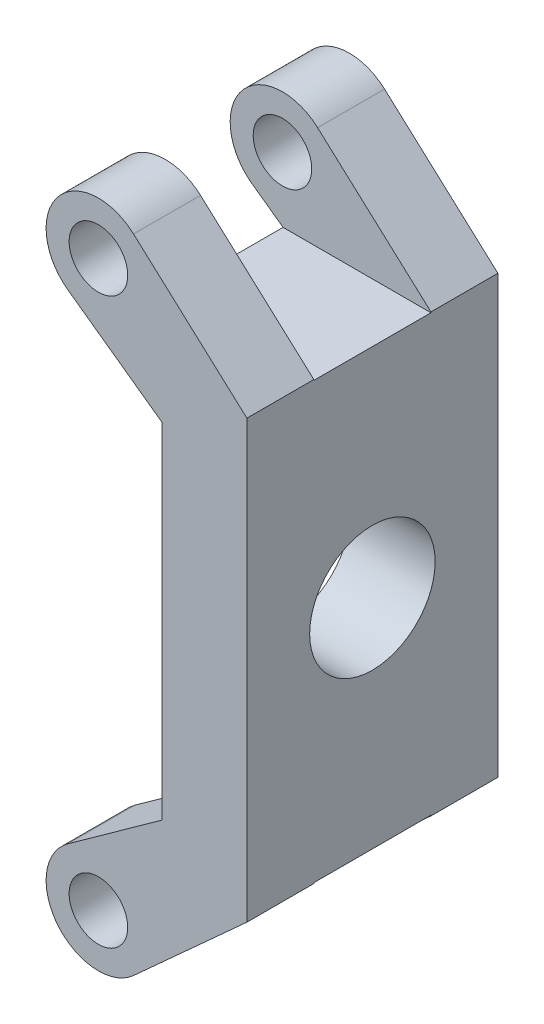
ISO-10303-21;
HEADER;
FILE_DESCRIPTION(('STEP AP214'),'2;1');
FILE_NAME('part.step','',(''),(''),'','','');
FILE_SCHEMA(('AUTOMOTIVE_DESIGN { 1 0 10303 214 1 1 1 1 }'));
ENDSEC;
DATA;
#1=APPLICATION_CONTEXT('core data for automotive mechanical design processes');
#2=APPLICATION_PROTOCOL_DEFINITION('international standard','automotive_design',2000,#1);
#3=PRODUCT_CONTEXT('',#1,'mechanical');
#4=PRODUCT('Part','Part','',(#3));
#5=PRODUCT_RELATED_PRODUCT_CATEGORY('part','',(#4));
#6=PRODUCT_DEFINITION_FORMATION('','',#4);
#7=PRODUCT_DEFINITION_CONTEXT('part definition',#1,'design');
#8=PRODUCT_DEFINITION('design','',#6,#7);
#9=PRODUCT_DEFINITION_SHAPE('','',#8);
#10=(LENGTH_UNIT() NAMED_UNIT(*) SI_UNIT(.MILLI.,.METRE.));
#11=(NAMED_UNIT(*) PLANE_ANGLE_UNIT() SI_UNIT($,.RADIAN.));
#12=(NAMED_UNIT(*) SI_UNIT($,.STERADIAN.) SOLID_ANGLE_UNIT());
#13=UNCERTAINTY_MEASURE_WITH_UNIT(LENGTH_MEASURE(1.E-05),#10,'distance_accuracy_value','');
#14=(GEOMETRIC_REPRESENTATION_CONTEXT(3) GLOBAL_UNCERTAINTY_ASSIGNED_CONTEXT((#13)) GLOBAL_UNIT_ASSIGNED_CONTEXT((#10,
#11,#12)) REPRESENTATION_CONTEXT('',''));
#15=CARTESIAN_POINT('',(0.,0.,0.));
#16=DIRECTION('',(0.,0.,1.));
#17=DIRECTION('',(1.,0.,0.));
#18=AXIS2_PLACEMENT_3D('',#15,#16,#17);
#19=CARTESIAN_POINT('',(12.,20.,-7.5));
#20=DIRECTION('',(0.,0.,1.));
#21=DIRECTION('',(0.,-1.,0.));
#22=AXIS2_PLACEMENT_3D('',#19,#20,#21);
#23=PLANE('',#22);
#24=CARTESIAN_POINT('',(3.12597981767234,-16.8740201823277,-7.5));
#25=DIRECTION('',(0.,0.,1.));
#26=DIRECTION('',(1.,0.,0.));
#27=AXIS2_PLACEMENT_3D('',#24,#25,#26);
#28=CIRCLE('',#27,1.75);
#29=CARTESIAN_POINT('',(4.87597981767234,-16.8740201823277,-7.5));
#30=VERTEX_POINT('',#29);
#31=EDGE_CURVE('E574',#30,#30,#28,.T.);
#32=ORIENTED_EDGE('',*,*,#31,.T.);
#33=EDGE_LOOP('',(#32));
#34=FACE_BOUND('',#33,.T.);
#35=CARTESIAN_POINT('',(3.12597981767234,16.8740201823277,-7.5));
#36=DIRECTION('',(0.,0.,1.));
#37=DIRECTION('',(1.,0.,0.));
#38=AXIS2_PLACEMENT_3D('',#35,#36,#37);
#39=CIRCLE('',#38,1.75);
#40=CARTESIAN_POINT('',(4.87597981767234,16.8740201823277,-7.5));
#41=VERTEX_POINT('',#40);
#42=EDGE_CURVE('E447',#41,#41,#39,.T.);
#43=ORIENTED_EDGE('',*,*,#42,.T.);
#44=EDGE_LOOP('',(#43));
#45=FACE_BOUND('',#44,.T.);
#46=DIRECTION('',(0.812110481398578,-0.583503698362375,0.));
#47=VECTOR('',#46,1.);
#48=CARTESIAN_POINT('',(7.23638507911774,10.0714771588957,-7.5));
#49=LINE('',#48,#47);
#50=CARTESIAN_POINT('',(1.30195903305439,14.3353792077555,-7.5));
#51=VERTEX_POINT('',#50);
#52=CARTESIAN_POINT('',(6.93431250857424,10.28851716284,-7.5));
#53=VERTEX_POINT('',#52);
#54=EDGE_CURVE('E380',#51,#53,#49,.T.);
#55=ORIENTED_EDGE('',*,*,#54,.F.);
#56=CARTESIAN_POINT('',(3.12597981767234,16.8740201823277,-7.5));
#57=DIRECTION('',(0.,0.,1.));
#58=DIRECTION('',(1.,0.,0.));
#59=AXIS2_PLACEMENT_3D('',#56,#57,#58);
#60=CIRCLE('',#59,3.12597981767234);
#61=CARTESIAN_POINT('',(5.22642565496868,19.1891610214731,-7.5));
#62=VERTEX_POINT('',#61);
#63=EDGE_CURVE('E429',#51,#62,#60,.F.);
#64=ORIENTED_EDGE('',*,*,#63,.T.);
#65=DIRECTION('',(0.740612855546003,-0.671931989266768,0.));
#66=VECTOR('',#65,1.);
#67=CARTESIAN_POINT('',(11.9090147836896,13.1262829967546,-7.5));
#68=LINE('',#67,#66);
#69=CARTESIAN_POINT('',(12.,13.0437353108327,-7.5));
#70=VERTEX_POINT('',#69);
#71=EDGE_CURVE('E421',#62,#70,#68,.T.);
#72=ORIENTED_EDGE('',*,*,#71,.T.);
#73=DIRECTION('',(0.,1.,0.));
#74=VECTOR('',#73,1.);
#75=CARTESIAN_POINT('',(12.,20.,-7.5));
#76=LINE('',#75,#74);
#77=CARTESIAN_POINT('',(12.,-13.0437353108327,-7.5));
#78=VERTEX_POINT('',#77);
#79=EDGE_CURVE('E360',#78,#70,#76,.T.);
#80=ORIENTED_EDGE('',*,*,#79,.F.);
#81=DIRECTION('',(-0.740612855546003,-0.671931989266768,0.));
#82=VECTOR('',#81,1.);
#83=CARTESIAN_POINT('',(11.9090147836896,-13.1262829967546,-7.5));
#84=LINE('',#83,#82);
#85=CARTESIAN_POINT('',(5.22642565496868,-19.1891610214731,-7.5));
#86=VERTEX_POINT('',#85);
#87=EDGE_CURVE('E350',#78,#86,#84,.T.);
#88=ORIENTED_EDGE('',*,*,#87,.T.);
#89=CARTESIAN_POINT('',(3.12597981767234,-16.8740201823277,-7.5));
#90=DIRECTION('',(0.,0.,1.));
#91=DIRECTION('',(1.,0.,0.));
#92=AXIS2_PLACEMENT_3D('',#89,#90,#91);
#93=CIRCLE('',#92,3.12597981767234);
#94=CARTESIAN_POINT('',(1.30195903305439,-14.3353792077555,-7.5));
#95=VERTEX_POINT('',#94);
#96=EDGE_CURVE('E335',#86,#95,#93,.F.);
#97=ORIENTED_EDGE('',*,*,#96,.T.);
#98=DIRECTION('',(-0.812110481398578,-0.583503698362375,0.));
#99=VECTOR('',#98,1.);
#100=CARTESIAN_POINT('',(7.23638507911775,-10.0714771588957,-7.5));
#101=LINE('',#100,#99);
#102=CARTESIAN_POINT('',(6.93431250857424,-10.28851716284,-7.5));
#103=VERTEX_POINT('',#102);
#104=EDGE_CURVE('E344',#103,#95,#101,.T.);
#105=ORIENTED_EDGE('',*,*,#104,.F.);
#106=DIRECTION('',(0.,-1.,0.));
#107=VECTOR('',#106,1.);
#108=CARTESIAN_POINT('',(6.93431250857424,0.,-7.5));
#109=LINE('',#108,#107);
#110=EDGE_CURVE('E378',#53,#103,#109,.T.);
#111=ORIENTED_EDGE('',*,*,#110,.F.);
#112=EDGE_LOOP('',(#55,#64,#72,#80,#88,#97,#105,#111));
#113=FACE_BOUND('',#112,.T.);
#114=ADVANCED_FACE('F209',(#34,#45,#113),#23,.F.);
#115=CARTESIAN_POINT('',(12.,13.,-3.5));
#116=DIRECTION('',(0.,0.,-1.));
#117=DIRECTION('',(0.,1.,0.));
#118=AXIS2_PLACEMENT_3D('',#115,#116,#117);
#119=PLANE('',#118);
#120=CARTESIAN_POINT('',(3.12597981767234,16.8740201823277,-3.5));
#121=DIRECTION('',(0.,0.,-1.));
#122=DIRECTION('',(0.,1.,0.));
#123=AXIS2_PLACEMENT_3D('',#120,#121,#122);
#124=CIRCLE('',#123,1.75);
#125=CARTESIAN_POINT('',(3.12597981767234,18.6240201823277,-3.5));
#126=VERTEX_POINT('',#125);
#127=EDGE_CURVE('E455',#126,#126,#124,.T.);
#128=ORIENTED_EDGE('',*,*,#127,.T.);
#129=EDGE_LOOP('',(#128));
#130=FACE_BOUND('',#129,.T.);
#131=CARTESIAN_POINT('',(3.12597981767234,16.8740201823277,-3.5));
#132=DIRECTION('',(0.,0.,-1.));
#133=DIRECTION('',(0.,1.,0.));
#134=AXIS2_PLACEMENT_3D('',#131,#132,#133);
#135=CIRCLE('',#134,3.12597981767234);
#136=CARTESIAN_POINT('',(5.22642565496868,19.1891610214731,-3.5));
#137=VERTEX_POINT('',#136);
#138=CARTESIAN_POINT('',(1.30195903305439,14.3353792077555,-3.5));
#139=VERTEX_POINT('',#138);
#140=EDGE_CURVE('E438',#137,#139,#135,.F.);
#141=ORIENTED_EDGE('',*,*,#140,.T.);
#142=DIRECTION('',(-0.812110481398578,0.583503698362375,0.));
#143=VECTOR('',#142,1.);
#144=CARTESIAN_POINT('',(8.99036318521296,8.81123888443003,-3.5));
#145=LINE('',#144,#143);
#146=CARTESIAN_POINT('',(3.16051700672895,13.,-3.5));
#147=VERTEX_POINT('',#146);
#148=EDGE_CURVE('E414',#147,#139,#145,.T.);
#149=ORIENTED_EDGE('',*,*,#148,.F.);
#150=DIRECTION('',(-1.,0.,0.));
#151=VECTOR('',#150,1.);
#152=CARTESIAN_POINT('',(12.,13.,-3.5));
#153=LINE('',#152,#151);
#154=CARTESIAN_POINT('',(12.,13.,-3.5));
#155=VERTEX_POINT('',#154);
#156=EDGE_CURVE('E485',#155,#147,#153,.T.);
#157=ORIENTED_EDGE('',*,*,#156,.F.);
#158=DIRECTION('',(0.,-1.,0.));
#159=VECTOR('',#158,1.);
#160=CARTESIAN_POINT('',(12.,13.,-3.5));
#161=LINE('',#160,#159);
#162=CARTESIAN_POINT('',(12.,13.0437353108327,-3.5));
#163=VERTEX_POINT('',#162);
#164=EDGE_CURVE('E462',#163,#155,#161,.T.);
#165=ORIENTED_EDGE('',*,*,#164,.F.);
#166=DIRECTION('',(-0.740612855546003,0.671931989266768,0.));
#167=VECTOR('',#166,1.);
#168=CARTESIAN_POINT('',(12.0217645043432,13.0239891417118,-3.5));
#169=LINE('',#168,#167);
#170=EDGE_CURVE('E443',#163,#137,#169,.T.);
#171=ORIENTED_EDGE('',*,*,#170,.T.);
#172=EDGE_LOOP('',(#141,#149,#157,#165,#171));
#173=FACE_BOUND('',#172,.T.);
#174=ADVANCED_FACE('F521',(#130,#173),#119,.F.);
#175=CARTESIAN_POINT('',(12.,13.,3.5));
#176=DIRECTION('',(0.,-1.,0.));
#177=DIRECTION('',(0.,0.,-1.));
#178=AXIS2_PLACEMENT_3D('',#175,#176,#177);
#179=PLANE('',#178);
#180=DIRECTION('',(0.,0.,-1.));
#181=VECTOR('',#180,1.);
#182=CARTESIAN_POINT('',(3.16051700672895,13.,3.5));
#183=LINE('',#182,#181);
#184=CARTESIAN_POINT('',(3.16051700672896,13.,3.5));
#185=VERTEX_POINT('',#184);
#186=EDGE_CURVE('E412',#185,#147,#183,.T.);
#187=ORIENTED_EDGE('',*,*,#186,.F.);
#188=DIRECTION('',(-1.,0.,0.));
#189=VECTOR('',#188,1.);
#190=CARTESIAN_POINT('',(12.,13.,3.5));
#191=LINE('',#190,#189);
#192=CARTESIAN_POINT('',(12.,13.,3.5));
#193=VERTEX_POINT('',#192);
#194=EDGE_CURVE('E482',#193,#185,#191,.T.);
#195=ORIENTED_EDGE('',*,*,#194,.F.);
#196=DIRECTION('',(0.,0.,1.));
#197=VECTOR('',#196,1.);
#198=CARTESIAN_POINT('',(12.,13.,3.5));
#199=LINE('',#198,#197);
#200=EDGE_CURVE('E464',#155,#193,#199,.T.);
#201=ORIENTED_EDGE('',*,*,#200,.F.);
#202=ORIENTED_EDGE('',*,*,#156,.T.);
#203=EDGE_LOOP('',(#187,#195,#201,#202));
#204=FACE_BOUND('',#203,.T.);
#205=ADVANCED_FACE('F526',(#204),#179,.F.);
#206=CARTESIAN_POINT('',(12.,20.,3.5));
#207=DIRECTION('',(0.,0.,1.));
#208=DIRECTION('',(0.,-1.,0.));
#209=AXIS2_PLACEMENT_3D('',#206,#207,#208);
#210=PLANE('',#209);
#211=CARTESIAN_POINT('',(3.12597981767234,16.8740201823277,3.5));
#212=DIRECTION('',(0.,0.,1.));
#213=DIRECTION('',(0.,-1.,0.));
#214=AXIS2_PLACEMENT_3D('',#211,#212,#213);
#215=CIRCLE('',#214,1.75);
#216=CARTESIAN_POINT('',(3.12597981767234,15.1240201823277,3.5));
#217=VERTEX_POINT('',#216);
#218=EDGE_CURVE('E450',#217,#217,#215,.T.);
#219=ORIENTED_EDGE('',*,*,#218,.T.);
#220=EDGE_LOOP('',(#219));
#221=FACE_BOUND('',#220,.T.);
#222=DIRECTION('',(0.812110481398578,-0.583503698362375,0.));
#223=VECTOR('',#222,1.);
#224=CARTESIAN_POINT('',(5.67327689958853,11.194574846448,3.5));
#225=LINE('',#224,#223);
#226=CARTESIAN_POINT('',(1.30195903305439,14.3353792077555,3.5));
#227=VERTEX_POINT('',#226);
#228=EDGE_CURVE('E410',#227,#185,#225,.T.);
#229=ORIENTED_EDGE('',*,*,#228,.F.);
#230=CARTESIAN_POINT('',(3.12597981767234,16.8740201823277,3.5));
#231=DIRECTION('',(0.,0.,1.));
#232=DIRECTION('',(0.,-1.,0.));
#233=AXIS2_PLACEMENT_3D('',#230,#231,#232);
#234=CIRCLE('',#233,3.12597981767234);
#235=CARTESIAN_POINT('',(5.22642565496868,19.1891610214731,3.5));
#236=VERTEX_POINT('',#235);
#237=EDGE_CURVE('E432',#227,#236,#234,.F.);
#238=ORIENTED_EDGE('',*,*,#237,.T.);
#239=DIRECTION('',(0.740612855546003,-0.671931989266768,0.));
#240=VECTOR('',#239,1.);
#241=CARTESIAN_POINT('',(8.53827421921827,16.1844373291117,3.5));
#242=LINE('',#241,#240);
#243=CARTESIAN_POINT('',(12.,13.0437353108327,3.5));
#244=VERTEX_POINT('',#243);
#245=EDGE_CURVE('E440',#236,#244,#242,.T.);
#246=ORIENTED_EDGE('',*,*,#245,.T.);
#247=DIRECTION('',(0.,1.,0.));
#248=VECTOR('',#247,1.);
#249=CARTESIAN_POINT('',(12.,20.,3.5));
#250=LINE('',#249,#248);
#251=EDGE_CURVE('E466',#193,#244,#250,.T.);
#252=ORIENTED_EDGE('',*,*,#251,.F.);
#253=ORIENTED_EDGE('',*,*,#194,.T.);
#254=EDGE_LOOP('',(#229,#238,#246,#252,#253));
#255=FACE_BOUND('',#254,.T.);
#256=ADVANCED_FACE('F532',(#221,#255),#210,.F.);
#257=CARTESIAN_POINT('',(12.,20.,7.5));
#258=DIRECTION('',(0.,0.,-1.));
#259=DIRECTION('',(0.,1.,0.));
#260=AXIS2_PLACEMENT_3D('',#257,#258,#259);
#261=PLANE('',#260);
#262=CARTESIAN_POINT('',(3.12597981767234,-16.8740201823277,7.5));
#263=DIRECTION('',(0.,0.,1.));
#264=DIRECTION('',(1.,0.,0.));
#265=AXIS2_PLACEMENT_3D('',#262,#263,#264);
#266=CIRCLE('',#265,1.75);
#267=CARTESIAN_POINT('',(4.87597981767234,-16.8740201823277,7.5));
#268=VERTEX_POINT('',#267);
#269=EDGE_CURVE('E762',#268,#268,#266,.T.);
#270=ORIENTED_EDGE('',*,*,#269,.F.);
#271=EDGE_LOOP('',(#270));
#272=FACE_BOUND('',#271,.T.);
#273=CARTESIAN_POINT('',(3.12597981767234,16.8740201823277,7.5));
#274=DIRECTION('',(0.,0.,1.));
#275=DIRECTION('',(1.,0.,0.));
#276=AXIS2_PLACEMENT_3D('',#273,#274,#275);
#277=CIRCLE('',#276,1.75);
#278=CARTESIAN_POINT('',(4.87597981767234,16.8740201823277,7.5));
#279=VERTEX_POINT('',#278);
#280=EDGE_CURVE('E446',#279,#279,#277,.T.);
#281=ORIENTED_EDGE('',*,*,#280,.F.);
#282=EDGE_LOOP('',(#281));
#283=FACE_BOUND('',#282,.T.);
#284=CARTESIAN_POINT('',(3.12597981767234,16.8740201823277,7.5));
#285=DIRECTION('',(0.,0.,1.));
#286=DIRECTION('',(1.,0.,0.));
#287=AXIS2_PLACEMENT_3D('',#284,#285,#286);
#288=CIRCLE('',#287,3.12597981767234);
#289=CARTESIAN_POINT('',(1.30195903305439,14.3353792077555,7.5));
#290=VERTEX_POINT('',#289);
#291=CARTESIAN_POINT('',(5.22642565496868,19.1891610214731,7.5));
#292=VERTEX_POINT('',#291);
#293=EDGE_CURVE('E428',#290,#292,#288,.F.);
#294=ORIENTED_EDGE('',*,*,#293,.F.);
#295=DIRECTION('',(0.812110481398578,-0.583503698362375,0.));
#296=VECTOR('',#295,1.);
#297=CARTESIAN_POINT('',(7.23638507911774,10.0714771588957,7.5));
#298=LINE('',#297,#296);
#299=CARTESIAN_POINT('',(6.93431250857424,10.28851716284,7.5));
#300=VERTEX_POINT('',#299);
#301=EDGE_CURVE('E345',#290,#300,#298,.T.);
#302=ORIENTED_EDGE('',*,*,#301,.T.);
#303=DIRECTION('',(0.,-1.,0.));
#304=VECTOR('',#303,1.);
#305=CARTESIAN_POINT('',(6.93431250857424,0.,7.5));
#306=LINE('',#305,#304);
#307=CARTESIAN_POINT('',(6.93431250857424,-10.28851716284,7.5));
#308=VERTEX_POINT('',#307);
#309=EDGE_CURVE('E388',#300,#308,#306,.T.);
#310=ORIENTED_EDGE('',*,*,#309,.T.);
#311=DIRECTION('',(-0.812110481398578,-0.583503698362375,0.));
#312=VECTOR('',#311,1.);
#313=CARTESIAN_POINT('',(7.23638507911775,-10.0714771588957,7.5));
#314=LINE('',#313,#312);
#315=CARTESIAN_POINT('',(1.30195903305439,-14.3353792077555,7.5));
#316=VERTEX_POINT('',#315);
#317=EDGE_CURVE('E385',#308,#316,#314,.T.);
#318=ORIENTED_EDGE('',*,*,#317,.T.);
#319=CARTESIAN_POINT('',(3.12597981767234,-16.8740201823277,7.5));
#320=DIRECTION('',(0.,0.,1.));
#321=DIRECTION('',(1.,0.,0.));
#322=AXIS2_PLACEMENT_3D('',#319,#320,#321);
#323=CIRCLE('',#322,3.12597981767234);
#324=CARTESIAN_POINT('',(5.22642565496868,-19.1891610214731,7.5));
#325=VERTEX_POINT('',#324);
#326=EDGE_CURVE('E375',#325,#316,#323,.F.);
#327=ORIENTED_EDGE('',*,*,#326,.F.);
#328=DIRECTION('',(-0.740612855546003,-0.671931989266768,0.));
#329=VECTOR('',#328,1.);
#330=CARTESIAN_POINT('',(11.9090147836896,-13.1262829967546,7.5));
#331=LINE('',#330,#329);
#332=CARTESIAN_POINT('',(12.,-13.0437353108327,7.5));
#333=VERTEX_POINT('',#332);
#334=EDGE_CURVE('E361',#333,#325,#331,.T.);
#335=ORIENTED_EDGE('',*,*,#334,.F.);
#336=DIRECTION('',(0.,-1.,0.));
#337=VECTOR('',#336,1.);
#338=CARTESIAN_POINT('',(12.,20.,7.5));
#339=LINE('',#338,#337);
#340=CARTESIAN_POINT('',(12.,13.0437353108327,7.5));
#341=VERTEX_POINT('',#340);
#342=EDGE_CURVE('E469',#341,#333,#339,.T.);
#343=ORIENTED_EDGE('',*,*,#342,.F.);
#344=DIRECTION('',(0.740612855546003,-0.671931989266768,0.));
#345=VECTOR('',#344,1.);
#346=CARTESIAN_POINT('',(11.9090147836896,13.1262829967546,7.5));
#347=LINE('',#346,#345);
#348=EDGE_CURVE('E426',#292,#341,#347,.T.);
#349=ORIENTED_EDGE('',*,*,#348,.F.);
#350=EDGE_LOOP('',(#294,#302,#310,#318,#327,#335,#343,#349));
#351=FACE_BOUND('',#350,.T.);
#352=ADVANCED_FACE('F541',(#272,#283,#351),#261,.F.);
#353=CARTESIAN_POINT('',(12.,-13.,3.5));
#354=DIRECTION('',(0.,0.,1.));
#355=DIRECTION('',(0.,-1.,0.));
#356=AXIS2_PLACEMENT_3D('',#353,#354,#355);
#357=PLANE('',#356);
#358=CARTESIAN_POINT('',(3.12597981767234,-16.8740201823277,3.5));
#359=DIRECTION('',(0.,0.,1.));
#360=DIRECTION('',(0.,-1.,0.));
#361=AXIS2_PLACEMENT_3D('',#358,#359,#360);
#362=CIRCLE('',#361,1.75);
#363=CARTESIAN_POINT('',(3.12597981767234,-18.6240201823277,3.5));
#364=VERTEX_POINT('',#363);
#365=EDGE_CURVE('E365',#364,#364,#362,.T.);
#366=ORIENTED_EDGE('',*,*,#365,.T.);
#367=EDGE_LOOP('',(#366));
#368=FACE_BOUND('',#367,.T.);
#369=DIRECTION('',(-0.740612855546003,-0.671931989266768,0.));
#370=VECTOR('',#369,1.);
#371=CARTESIAN_POINT('',(12.0217645043432,-13.0239891417118,3.5));
#372=LINE('',#371,#370);
#373=CARTESIAN_POINT('',(12.,-13.0437353108327,3.5));
#374=VERTEX_POINT('',#373);
#375=CARTESIAN_POINT('',(5.22642565496868,-19.1891610214731,3.5));
#376=VERTEX_POINT('',#375);
#377=EDGE_CURVE('E373',#374,#376,#372,.T.);
#378=ORIENTED_EDGE('',*,*,#377,.T.);
#379=CARTESIAN_POINT('',(3.12597981767234,-16.8740201823277,3.5));
#380=DIRECTION('',(0.,0.,1.));
#381=DIRECTION('',(0.,-1.,0.));
#382=AXIS2_PLACEMENT_3D('',#379,#380,#381);
#383=CIRCLE('',#382,3.12597981767234);
#384=CARTESIAN_POINT('',(1.30195903305439,-14.3353792077555,3.5));
#385=VERTEX_POINT('',#384);
#386=EDGE_CURVE('E403',#376,#385,#383,.F.);
#387=ORIENTED_EDGE('',*,*,#386,.T.);
#388=DIRECTION('',(-0.812110481398578,-0.583503698362375,0.));
#389=VECTOR('',#388,1.);
#390=CARTESIAN_POINT('',(8.99036318521297,-8.81123888443003,3.5));
#391=LINE('',#390,#389);
#392=CARTESIAN_POINT('',(3.16051700672897,-13.,3.5));
#393=VERTEX_POINT('',#392);
#394=EDGE_CURVE('E408',#393,#385,#391,.T.);
#395=ORIENTED_EDGE('',*,*,#394,.F.);
#396=DIRECTION('',(-1.,0.,0.));
#397=VECTOR('',#396,1.);
#398=CARTESIAN_POINT('',(12.,-13.,3.5));
#399=LINE('',#398,#397);
#400=CARTESIAN_POINT('',(12.,-13.,3.5));
#401=VERTEX_POINT('',#400);
#402=EDGE_CURVE('E479',#401,#393,#399,.T.);
#403=ORIENTED_EDGE('',*,*,#402,.F.);
#404=DIRECTION('',(0.,1.,0.));
#405=VECTOR('',#404,1.);
#406=CARTESIAN_POINT('',(12.,-13.,3.5));
#407=LINE('',#406,#405);
#408=EDGE_CURVE('E229',#374,#401,#407,.T.);
#409=ORIENTED_EDGE('',*,*,#408,.F.);
#410=EDGE_LOOP('',(#378,#387,#395,#403,#409));
#411=FACE_BOUND('',#410,.T.);
#412=ADVANCED_FACE('F545',(#368,#411),#357,.F.);
#413=CARTESIAN_POINT('',(12.,-13.,-3.5));
#414=DIRECTION('',(0.,1.,0.));
#415=DIRECTION('',(0.,0.,1.));
#416=AXIS2_PLACEMENT_3D('',#413,#414,#415);
#417=PLANE('',#416);
#418=DIRECTION('',(0.,0.,1.));
#419=VECTOR('',#418,1.);
#420=CARTESIAN_POINT('',(3.16051700672897,-13.,-3.5));
#421=LINE('',#420,#419);
#422=CARTESIAN_POINT('',(3.16051700672897,-13.,-3.5));
#423=VERTEX_POINT('',#422);
#424=EDGE_CURVE('E406',#423,#393,#421,.T.);
#425=ORIENTED_EDGE('',*,*,#424,.F.);
#426=DIRECTION('',(-1.,0.,0.));
#427=VECTOR('',#426,1.);
#428=CARTESIAN_POINT('',(12.,-13.,-3.5));
#429=LINE('',#428,#427);
#430=CARTESIAN_POINT('',(12.,-13.,-3.5));
#431=VERTEX_POINT('',#430);
#432=EDGE_CURVE('E476',#431,#423,#429,.T.);
#433=ORIENTED_EDGE('',*,*,#432,.F.);
#434=DIRECTION('',(0.,0.,-1.));
#435=VECTOR('',#434,1.);
#436=CARTESIAN_POINT('',(12.,-13.,-3.5));
#437=LINE('',#436,#435);
#438=EDGE_CURVE('E224',#401,#431,#437,.T.);
#439=ORIENTED_EDGE('',*,*,#438,.F.);
#440=ORIENTED_EDGE('',*,*,#402,.T.);
#441=EDGE_LOOP('',(#425,#433,#439,#440));
#442=FACE_BOUND('',#441,.T.);
#443=ADVANCED_FACE('F548',(#442),#417,.F.);
#444=CARTESIAN_POINT('',(12.,-20.,-3.5));
#445=DIRECTION('',(0.,0.,-1.));
#446=DIRECTION('',(-1.,0.,0.));
#447=AXIS2_PLACEMENT_3D('',#444,#445,#446);
#448=PLANE('',#447);
#449=CARTESIAN_POINT('',(3.12597981767234,-16.8740201823277,-3.5));
#450=DIRECTION('',(0.,0.,-1.));
#451=DIRECTION('',(-1.,0.,0.));
#452=AXIS2_PLACEMENT_3D('',#449,#450,#451);
#453=CIRCLE('',#452,1.75);
#454=CARTESIAN_POINT('',(1.37597981767234,-16.8740201823277,-3.5));
#455=VERTEX_POINT('',#454);
#456=EDGE_CURVE('E212',#455,#455,#453,.T.);
#457=ORIENTED_EDGE('',*,*,#456,.T.);
#458=EDGE_LOOP('',(#457));
#459=FACE_BOUND('',#458,.T.);
#460=CARTESIAN_POINT('',(3.12597981767234,-16.8740201823277,-3.5));
#461=DIRECTION('',(0.,0.,-1.));
#462=DIRECTION('',(-1.,0.,0.));
#463=AXIS2_PLACEMENT_3D('',#460,#461,#462);
#464=CIRCLE('',#463,3.12597981767234);
#465=CARTESIAN_POINT('',(1.30195903305439,-14.3353792077555,-3.5));
#466=VERTEX_POINT('',#465);
#467=CARTESIAN_POINT('',(5.22642565496868,-19.1891610214731,-3.5));
#468=VERTEX_POINT('',#467);
#469=EDGE_CURVE('E217',#466,#468,#464,.F.);
#470=ORIENTED_EDGE('',*,*,#469,.T.);
#471=DIRECTION('',(0.740612855546003,0.671931989266768,0.));
#472=VECTOR('',#471,1.);
#473=CARTESIAN_POINT('',(8.53827421921827,-16.1844373291117,-3.5));
#474=LINE('',#473,#472);
#475=CARTESIAN_POINT('',(12.,-13.0437353108327,-3.5));
#476=VERTEX_POINT('',#475);
#477=EDGE_CURVE('E353',#468,#476,#474,.T.);
#478=ORIENTED_EDGE('',*,*,#477,.T.);
#479=DIRECTION('',(0.,-1.,0.));
#480=VECTOR('',#479,1.);
#481=CARTESIAN_POINT('',(12.,-20.,-3.5));
#482=LINE('',#481,#480);
#483=EDGE_CURVE('E474',#431,#476,#482,.T.);
#484=ORIENTED_EDGE('',*,*,#483,.F.);
#485=ORIENTED_EDGE('',*,*,#432,.T.);
#486=DIRECTION('',(0.812110481398578,0.583503698362375,0.));
#487=VECTOR('',#486,1.);
#488=CARTESIAN_POINT('',(5.67327689958853,-11.194574846448,-3.5));
#489=LINE('',#488,#487);
#490=EDGE_CURVE('E12',#466,#423,#489,.T.);
#491=ORIENTED_EDGE('',*,*,#490,.F.);
#492=EDGE_LOOP('',(#470,#478,#484,#485,#491));
#493=FACE_BOUND('',#492,.T.);
#494=ADVANCED_FACE('F492',(#459,#493),#448,.F.);
#495=CARTESIAN_POINT('',(12.,0.,0.));
#496=DIRECTION('',(-1.,0.,0.));
#497=DIRECTION('',(0.,0.,1.));
#498=AXIS2_PLACEMENT_3D('',#495,#496,#497);
#499=CYLINDRICAL_SURFACE('',#498,3.75);
#500=CARTESIAN_POINT('',(12.,0.,0.));
#501=DIRECTION('',(1.,0.,0.));
#502=DIRECTION('',(0.,0.,-1.));
#503=AXIS2_PLACEMENT_3D('',#500,#501,#502);
#504=CIRCLE('',#503,3.75);
#505=CARTESIAN_POINT('',(12.,0.,-3.75));
#506=VERTEX_POINT('',#505);
#507=EDGE_CURVE('E458',#506,#506,#504,.T.);
#508=ORIENTED_EDGE('',*,*,#507,.T.);
#509=EDGE_LOOP('',(#508));
#510=FACE_BOUND('',#509,.T.);
#511=CARTESIAN_POINT('',(6.93431250857424,0.,0.));
#512=DIRECTION('',(-1.,0.,0.));
#513=DIRECTION('',(0.,0.,1.));
#514=AXIS2_PLACEMENT_3D('',#511,#512,#513);
#515=CIRCLE('',#514,3.75);
#516=CARTESIAN_POINT('',(6.93431250857424,0.,3.75));
#517=VERTEX_POINT('',#516);
#518=EDGE_CURVE('E396',#517,#517,#515,.T.);
#519=ORIENTED_EDGE('',*,*,#518,.T.);
#520=EDGE_LOOP('',(#519));
#521=FACE_BOUND('',#520,.T.);
#522=ADVANCED_FACE('F591',(#510,#521),#499,.F.);
#523=CARTESIAN_POINT('',(12.,-20.,-7.5));
#524=DIRECTION('',(-1.,0.,0.));
#525=DIRECTION('',(0.,0.,1.));
#526=AXIS2_PLACEMENT_3D('',#523,#524,#525);
#527=PLANE('',#526);
#528=ORIENTED_EDGE('',*,*,#342,.T.);
#529=DIRECTION('',(0.,0.,1.));
#530=VECTOR('',#529,1.);
#531=CARTESIAN_POINT('',(12.,-13.0437353108327,-7.5));
#532=LINE('',#531,#530);
#533=EDGE_CURVE('E354',#374,#333,#532,.T.);
#534=ORIENTED_EDGE('',*,*,#533,.F.);
#535=ORIENTED_EDGE('',*,*,#408,.T.);
#536=ORIENTED_EDGE('',*,*,#438,.T.);
#537=ORIENTED_EDGE('',*,*,#483,.T.);
#538=EDGE_CURVE('E370',#78,#476,#532,.T.);
#539=ORIENTED_EDGE('',*,*,#538,.F.);
#540=ORIENTED_EDGE('',*,*,#79,.T.);
#541=DIRECTION('',(0.,0.,1.));
#542=VECTOR('',#541,1.);
#543=CARTESIAN_POINT('',(12.,13.0437353108327,-7.5));
#544=LINE('',#543,#542);
#545=EDGE_CURVE('E423',#70,#163,#544,.T.);
#546=ORIENTED_EDGE('',*,*,#545,.T.);
#547=ORIENTED_EDGE('',*,*,#164,.T.);
#548=ORIENTED_EDGE('',*,*,#200,.T.);
#549=ORIENTED_EDGE('',*,*,#251,.T.);
#550=EDGE_CURVE('E417',#244,#341,#544,.T.);
#551=ORIENTED_EDGE('',*,*,#550,.T.);
#552=EDGE_LOOP('',(#528,#534,#535,#536,#537,#539,#540,#546,#547,#548,#549,#551));
#553=FACE_BOUND('',#552,.T.);
#554=ORIENTED_EDGE('',*,*,#507,.F.);
#555=EDGE_LOOP('',(#554));
#556=FACE_BOUND('',#555,.T.);
#557=ADVANCED_FACE('F517',(#553,#556),#527,.F.);
#558=CARTESIAN_POINT('',(3.12597981767234,16.8740201823277,-7.5));
#559=DIRECTION('',(0.,0.,1.));
#560=DIRECTION('',(1.,0.,0.));
#561=AXIS2_PLACEMENT_3D('',#558,#559,#560);
#562=CYLINDRICAL_SURFACE('',#561,1.75);
#563=ORIENTED_EDGE('',*,*,#280,.T.);
#564=EDGE_LOOP('',(#563));
#565=FACE_BOUND('',#564,.T.);
#566=ORIENTED_EDGE('',*,*,#218,.F.);
#567=EDGE_LOOP('',(#566));
#568=FACE_BOUND('',#567,.T.);
#569=ADVANCED_FACE('F580',(#565,#568),#562,.F.);
#570=ORIENTED_EDGE('',*,*,#42,.F.);
#571=EDGE_LOOP('',(#570));
#572=FACE_BOUND('',#571,.T.);
#573=ORIENTED_EDGE('',*,*,#127,.F.);
#574=EDGE_LOOP('',(#573));
#575=FACE_BOUND('',#574,.T.);
#576=ADVANCED_FACE('F577',(#572,#575),#562,.F.);
#577=CARTESIAN_POINT('',(3.12597981767234,16.8740201823277,-7.5));
#578=DIRECTION('',(0.,0.,1.));
#579=DIRECTION('',(1.,0.,0.));
#580=AXIS2_PLACEMENT_3D('',#577,#578,#579);
#581=CYLINDRICAL_SURFACE('',#580,3.12597981767234);
#582=ORIENTED_EDGE('',*,*,#237,.F.);
#583=DIRECTION('',(0.,0.,1.));
#584=VECTOR('',#583,1.);
#585=CARTESIAN_POINT('',(1.30195903305439,14.3353792077555,-7.5));
#586=LINE('',#585,#584);
#587=EDGE_CURVE('E397',#227,#290,#586,.T.);
#588=ORIENTED_EDGE('',*,*,#587,.T.);
#589=ORIENTED_EDGE('',*,*,#293,.T.);
#590=DIRECTION('',(0.,0.,1.));
#591=VECTOR('',#590,1.);
#592=CARTESIAN_POINT('',(5.22642565496868,19.1891610214731,-7.5));
#593=LINE('',#592,#591);
#594=EDGE_CURVE('E422',#236,#292,#593,.T.);
#595=ORIENTED_EDGE('',*,*,#594,.F.);
#596=EDGE_LOOP('',(#582,#588,#589,#595));
#597=FACE_BOUND('',#596,.T.);
#598=ADVANCED_FACE('F537',(#597),#581,.T.);
#599=CARTESIAN_POINT('',(11.9090147836896,13.1262829967546,-7.5));
#600=DIRECTION('',(-0.671931989266768,-0.740612855546003,0.));
#601=DIRECTION('',(0.740612855546003,-0.671931989266768,0.));
#602=AXIS2_PLACEMENT_3D('',#599,#600,#601);
#603=PLANE('',#602);
#604=ORIENTED_EDGE('',*,*,#594,.T.);
#605=ORIENTED_EDGE('',*,*,#348,.T.);
#606=ORIENTED_EDGE('',*,*,#550,.F.);
#607=ORIENTED_EDGE('',*,*,#245,.F.);
#608=EDGE_LOOP('',(#604,#605,#606,#607));
#609=FACE_BOUND('',#608,.T.);
#610=ADVANCED_FACE('F535',(#609),#603,.F.);
#611=ORIENTED_EDGE('',*,*,#545,.F.);
#612=ORIENTED_EDGE('',*,*,#71,.F.);
#613=EDGE_CURVE('E418',#62,#137,#593,.T.);
#614=ORIENTED_EDGE('',*,*,#613,.T.);
#615=ORIENTED_EDGE('',*,*,#170,.F.);
#616=EDGE_LOOP('',(#611,#612,#614,#615));
#617=FACE_BOUND('',#616,.T.);
#618=ADVANCED_FACE('F515',(#617),#603,.F.);
#619=ORIENTED_EDGE('',*,*,#613,.F.);
#620=ORIENTED_EDGE('',*,*,#63,.F.);
#621=EDGE_CURVE('E393',#51,#139,#586,.T.);
#622=ORIENTED_EDGE('',*,*,#621,.T.);
#623=ORIENTED_EDGE('',*,*,#140,.F.);
#624=EDGE_LOOP('',(#619,#620,#622,#623));
#625=FACE_BOUND('',#624,.T.);
#626=ADVANCED_FACE('F511',(#625),#581,.T.);
#627=CARTESIAN_POINT('',(7.23638507911774,10.0714771588957,-7.5));
#628=DIRECTION('',(-0.583503698362375,-0.812110481398578,0.));
#629=DIRECTION('',(0.812110481398578,-0.583503698362375,0.));
#630=AXIS2_PLACEMENT_3D('',#627,#628,#629);
#631=PLANE('',#630);
#632=ORIENTED_EDGE('',*,*,#148,.T.);
#633=ORIENTED_EDGE('',*,*,#621,.F.);
#634=ORIENTED_EDGE('',*,*,#54,.T.);
#635=DIRECTION('',(0.,0.,1.));
#636=VECTOR('',#635,1.);
#637=CARTESIAN_POINT('',(6.93431250857424,10.28851716284,-7.5));
#638=LINE('',#637,#636);
#639=EDGE_CURVE('E398',#53,#300,#638,.T.);
#640=ORIENTED_EDGE('',*,*,#639,.T.);
#641=ORIENTED_EDGE('',*,*,#301,.F.);
#642=ORIENTED_EDGE('',*,*,#587,.F.);
#643=ORIENTED_EDGE('',*,*,#228,.T.);
#644=ORIENTED_EDGE('',*,*,#186,.T.);
#645=EDGE_LOOP('',(#632,#633,#634,#640,#641,#642,#643,#644));
#646=FACE_BOUND('',#645,.T.);
#647=ADVANCED_FACE('F506',(#646),#631,.T.);
#648=CARTESIAN_POINT('',(7.23638507911775,-10.0714771588957,-7.5));
#649=DIRECTION('',(-0.583503698362375,0.812110481398578,0.));
#650=DIRECTION('',(-0.812110481398578,-0.583503698362375,0.));
#651=AXIS2_PLACEMENT_3D('',#648,#649,#650);
#652=PLANE('',#651);
#653=ORIENTED_EDGE('',*,*,#394,.T.);
#654=DIRECTION('',(0.,0.,1.));
#655=VECTOR('',#654,1.);
#656=CARTESIAN_POINT('',(1.30195903305439,-14.3353792077555,-7.5));
#657=LINE('',#656,#655);
#658=EDGE_CURVE('E382',#385,#316,#657,.T.);
#659=ORIENTED_EDGE('',*,*,#658,.T.);
#660=ORIENTED_EDGE('',*,*,#317,.F.);
#661=DIRECTION('',(0.,0.,1.));
#662=VECTOR('',#661,1.);
#663=CARTESIAN_POINT('',(6.93431250857424,-10.28851716284,-7.5));
#664=LINE('',#663,#662);
#665=EDGE_CURVE('E400',#103,#308,#664,.T.);
#666=ORIENTED_EDGE('',*,*,#665,.F.);
#667=ORIENTED_EDGE('',*,*,#104,.T.);
#668=EDGE_CURVE('E340',#95,#466,#657,.T.);
#669=ORIENTED_EDGE('',*,*,#668,.T.);
#670=ORIENTED_EDGE('',*,*,#490,.T.);
#671=ORIENTED_EDGE('',*,*,#424,.T.);
#672=EDGE_LOOP('',(#653,#659,#660,#666,#667,#669,#670,#671));
#673=FACE_BOUND('',#672,.T.);
#674=ADVANCED_FACE('F495',(#673),#652,.T.);
#675=CARTESIAN_POINT('',(3.12597981767234,-16.8740201823277,-7.5));
#676=DIRECTION('',(0.,0.,1.));
#677=DIRECTION('',(1.,0.,0.));
#678=AXIS2_PLACEMENT_3D('',#675,#676,#677);
#679=CYLINDRICAL_SURFACE('',#678,3.12597981767234);
#680=ORIENTED_EDGE('',*,*,#386,.F.);
#681=DIRECTION('',(0.,0.,1.));
#682=VECTOR('',#681,1.);
#683=CARTESIAN_POINT('',(5.22642565496868,-19.1891610214731,-7.5));
#684=LINE('',#683,#682);
#685=EDGE_CURVE('E355',#376,#325,#684,.T.);
#686=ORIENTED_EDGE('',*,*,#685,.T.);
#687=ORIENTED_EDGE('',*,*,#326,.T.);
#688=ORIENTED_EDGE('',*,*,#658,.F.);
#689=EDGE_LOOP('',(#680,#686,#687,#688));
#690=FACE_BOUND('',#689,.T.);
#691=ADVANCED_FACE('F551',(#690),#679,.T.);
#692=ORIENTED_EDGE('',*,*,#668,.F.);
#693=ORIENTED_EDGE('',*,*,#96,.F.);
#694=EDGE_CURVE('E338',#86,#468,#684,.T.);
#695=ORIENTED_EDGE('',*,*,#694,.T.);
#696=ORIENTED_EDGE('',*,*,#469,.F.);
#697=EDGE_LOOP('',(#692,#693,#695,#696));
#698=FACE_BOUND('',#697,.T.);
#699=ADVANCED_FACE('F337',(#698),#679,.T.);
#700=CARTESIAN_POINT('',(6.93431250857424,0.,-7.5));
#701=DIRECTION('',(-1.,0.,0.));
#702=DIRECTION('',(0.,0.,1.));
#703=AXIS2_PLACEMENT_3D('',#700,#701,#702);
#704=PLANE('',#703);
#705=ORIENTED_EDGE('',*,*,#518,.F.);
#706=EDGE_LOOP('',(#705));
#707=FACE_BOUND('',#706,.T.);
#708=ORIENTED_EDGE('',*,*,#309,.F.);
#709=ORIENTED_EDGE('',*,*,#639,.F.);
#710=ORIENTED_EDGE('',*,*,#110,.T.);
#711=ORIENTED_EDGE('',*,*,#665,.T.);
#712=EDGE_LOOP('',(#708,#709,#710,#711));
#713=FACE_BOUND('',#712,.T.);
#714=ADVANCED_FACE('F503',(#707,#713),#704,.T.);
#715=CARTESIAN_POINT('',(11.9090147836896,-13.1262829967546,-7.5));
#716=DIRECTION('',(-0.671931989266768,0.740612855546003,0.));
#717=DIRECTION('',(-0.740612855546003,-0.671931989266768,0.));
#718=AXIS2_PLACEMENT_3D('',#715,#716,#717);
#719=PLANE('',#718);
#720=ORIENTED_EDGE('',*,*,#533,.T.);
#721=ORIENTED_EDGE('',*,*,#334,.T.);
#722=ORIENTED_EDGE('',*,*,#685,.F.);
#723=ORIENTED_EDGE('',*,*,#377,.F.);
#724=EDGE_LOOP('',(#720,#721,#722,#723));
#725=FACE_BOUND('',#724,.T.);
#726=ADVANCED_FACE('F553',(#725),#719,.F.);
#727=ORIENTED_EDGE('',*,*,#694,.F.);
#728=ORIENTED_EDGE('',*,*,#87,.F.);
#729=ORIENTED_EDGE('',*,*,#538,.T.);
#730=ORIENTED_EDGE('',*,*,#477,.F.);
#731=EDGE_LOOP('',(#727,#728,#729,#730));
#732=FACE_BOUND('',#731,.T.);
#733=ADVANCED_FACE('F349',(#732),#719,.F.);
#734=CARTESIAN_POINT('',(3.12597981767234,-16.8740201823277,-7.5));
#735=DIRECTION('',(0.,0.,1.));
#736=DIRECTION('',(1.,0.,0.));
#737=AXIS2_PLACEMENT_3D('',#734,#735,#736);
#738=CYLINDRICAL_SURFACE('',#737,1.75);
#739=ORIENTED_EDGE('',*,*,#31,.F.);
#740=EDGE_LOOP('',(#739));
#741=FACE_BOUND('',#740,.T.);
#742=ORIENTED_EDGE('',*,*,#456,.F.);
#743=EDGE_LOOP('',(#742));
#744=FACE_BOUND('',#743,.T.);
#745=ADVANCED_FACE('F560',(#741,#744),#738,.F.);
#746=ORIENTED_EDGE('',*,*,#269,.T.);
#747=EDGE_LOOP('',(#746));
#748=FACE_BOUND('',#747,.T.);
#749=ORIENTED_EDGE('',*,*,#365,.F.);
#750=EDGE_LOOP('',(#749));
#751=FACE_BOUND('',#750,.T.);
#752=ADVANCED_FACE('F747',(#748,#751),#738,.F.);
#753=CLOSED_SHELL('',(#114,#174,#205,#256,#352,#412,#443,#494,#522,#557,#569,#576,#598,#610,
#618,#626,#647,#674,#691,#699,#714,#726,#733,#745,#752));
#754=MANIFOLD_SOLID_BREP('B2',#753);
#755=ADVANCED_BREP_SHAPE_REPRESENTATION('',(#18,#754),#14);
#756=SHAPE_DEFINITION_REPRESENTATION(#9,#755);
ENDSEC;
END-ISO-10303-21;
